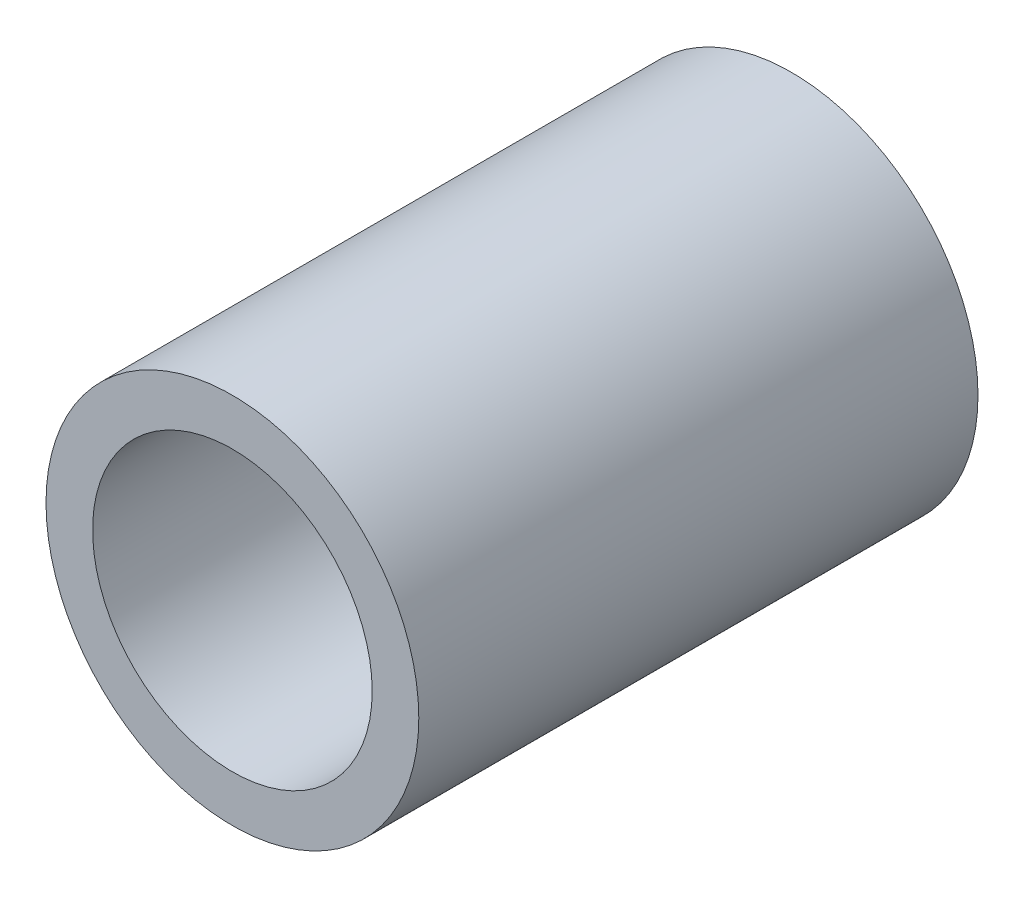
ISO-10303-21;
HEADER;
FILE_DESCRIPTION(('STEP AP214'),'2;1');
FILE_NAME('part.step','',(''),(''),'','','');
FILE_SCHEMA(('AUTOMOTIVE_DESIGN { 1 0 10303 214 1 1 1 1 }'));
ENDSEC;
DATA;
#1=APPLICATION_CONTEXT('core data for automotive mechanical design processes');
#2=APPLICATION_PROTOCOL_DEFINITION('international standard','automotive_design',2000,#1);
#3=PRODUCT_CONTEXT('',#1,'mechanical');
#4=PRODUCT('Part','Part','',(#3));
#5=PRODUCT_RELATED_PRODUCT_CATEGORY('part','',(#4));
#6=PRODUCT_DEFINITION_FORMATION('','',#4);
#7=PRODUCT_DEFINITION_CONTEXT('part definition',#1,'design');
#8=PRODUCT_DEFINITION('design','',#6,#7);
#9=PRODUCT_DEFINITION_SHAPE('','',#8);
#10=(LENGTH_UNIT() NAMED_UNIT(*) SI_UNIT(.MILLI.,.METRE.));
#11=(NAMED_UNIT(*) PLANE_ANGLE_UNIT() SI_UNIT($,.RADIAN.));
#12=(NAMED_UNIT(*) SI_UNIT($,.STERADIAN.) SOLID_ANGLE_UNIT());
#13=UNCERTAINTY_MEASURE_WITH_UNIT(LENGTH_MEASURE(1.E-05),#10,'distance_accuracy_value','');
#14=(GEOMETRIC_REPRESENTATION_CONTEXT(3) GLOBAL_UNCERTAINTY_ASSIGNED_CONTEXT((#13)) GLOBAL_UNIT_ASSIGNED_CONTEXT((#10,
#11,#12)) REPRESENTATION_CONTEXT('',''));
#15=CARTESIAN_POINT('',(0.,0.,0.));
#16=DIRECTION('',(0.,0.,1.));
#17=DIRECTION('',(1.,0.,0.));
#18=AXIS2_PLACEMENT_3D('',#15,#16,#17);
#19=CARTESIAN_POINT('',(0.,0.,24.));
#20=DIRECTION('',(0.,0.,1.));
#21=DIRECTION('',(1.,0.,0.));
#22=AXIS2_PLACEMENT_3D('',#19,#20,#21);
#23=PLANE('',#22);
#24=CARTESIAN_POINT('',(0.,0.,24.));
#25=DIRECTION('',(0.,0.,1.));
#26=DIRECTION('',(1.,0.,0.));
#27=AXIS2_PLACEMENT_3D('',#24,#25,#26);
#28=CIRCLE('',#27,8.);
#29=CARTESIAN_POINT('',(8.,0.,24.));
#30=VERTEX_POINT('',#29);
#31=EDGE_CURVE('E10',#30,#30,#28,.T.);
#32=ORIENTED_EDGE('',*,*,#31,.T.);
#33=EDGE_LOOP('',(#32));
#34=FACE_BOUND('',#33,.T.);
#35=CARTESIAN_POINT('',(0.,0.,24.));
#36=DIRECTION('',(0.,0.,1.));
#37=DIRECTION('',(1.,0.,0.));
#38=AXIS2_PLACEMENT_3D('',#35,#36,#37);
#39=CIRCLE('',#38,6.);
#40=CARTESIAN_POINT('',(6.,0.,24.));
#41=VERTEX_POINT('',#40);
#42=EDGE_CURVE('E41',#41,#41,#39,.T.);
#43=ORIENTED_EDGE('',*,*,#42,.F.);
#44=EDGE_LOOP('',(#43));
#45=FACE_BOUND('',#44,.T.);
#46=ADVANCED_FACE('F30',(#34,#45),#23,.T.);
#47=CARTESIAN_POINT('',(0.,0.,0.));
#48=DIRECTION('',(0.,0.,1.));
#49=DIRECTION('',(1.,0.,0.));
#50=AXIS2_PLACEMENT_3D('',#47,#48,#49);
#51=PLANE('',#50);
#52=CARTESIAN_POINT('',(0.,0.,0.));
#53=DIRECTION('',(0.,0.,1.));
#54=DIRECTION('',(1.,0.,0.));
#55=AXIS2_PLACEMENT_3D('',#52,#53,#54);
#56=CIRCLE('',#55,8.);
#57=CARTESIAN_POINT('',(8.,0.,0.));
#58=VERTEX_POINT('',#57);
#59=EDGE_CURVE('E34',#58,#58,#56,.T.);
#60=ORIENTED_EDGE('',*,*,#59,.F.);
#61=EDGE_LOOP('',(#60));
#62=FACE_BOUND('',#61,.T.);
#63=CARTESIAN_POINT('',(0.,0.,0.));
#64=DIRECTION('',(0.,0.,1.));
#65=DIRECTION('',(1.,0.,0.));
#66=AXIS2_PLACEMENT_3D('',#63,#64,#65);
#67=CIRCLE('',#66,6.);
#68=CARTESIAN_POINT('',(6.,0.,0.));
#69=VERTEX_POINT('',#68);
#70=EDGE_CURVE('E43',#69,#69,#67,.T.);
#71=ORIENTED_EDGE('',*,*,#70,.T.);
#72=EDGE_LOOP('',(#71));
#73=FACE_BOUND('',#72,.T.);
#74=ADVANCED_FACE('F53',(#62,#73),#51,.F.);
#75=CARTESIAN_POINT('',(0.,0.,24.));
#76=DIRECTION('',(0.,0.,-1.));
#77=DIRECTION('',(-1.,0.,0.));
#78=AXIS2_PLACEMENT_3D('',#75,#76,#77);
#79=CYLINDRICAL_SURFACE('',#78,8.);
#80=ORIENTED_EDGE('',*,*,#31,.F.);
#81=EDGE_LOOP('',(#80));
#82=FACE_BOUND('',#81,.T.);
#83=ORIENTED_EDGE('',*,*,#59,.T.);
#84=EDGE_LOOP('',(#83));
#85=FACE_BOUND('',#84,.T.);
#86=ADVANCED_FACE('F32',(#82,#85),#79,.T.);
#87=CARTESIAN_POINT('',(0.,0.,24.));
#88=DIRECTION('',(0.,0.,-1.));
#89=DIRECTION('',(-1.,0.,0.));
#90=AXIS2_PLACEMENT_3D('',#87,#88,#89);
#91=CYLINDRICAL_SURFACE('',#90,6.);
#92=ORIENTED_EDGE('',*,*,#42,.T.);
#93=EDGE_LOOP('',(#92));
#94=FACE_BOUND('',#93,.T.);
#95=ORIENTED_EDGE('',*,*,#70,.F.);
#96=EDGE_LOOP('',(#95));
#97=FACE_BOUND('',#96,.T.);
#98=ADVANCED_FACE('F49',(#94,#97),#91,.F.);
#99=CLOSED_SHELL('',(#46,#74,#86,#98));
#100=MANIFOLD_SOLID_BREP('B2',#99);
#101=ADVANCED_BREP_SHAPE_REPRESENTATION('',(#18,#100),#14);
#102=SHAPE_DEFINITION_REPRESENTATION(#9,#101);
ENDSEC;
END-ISO-10303-21;
